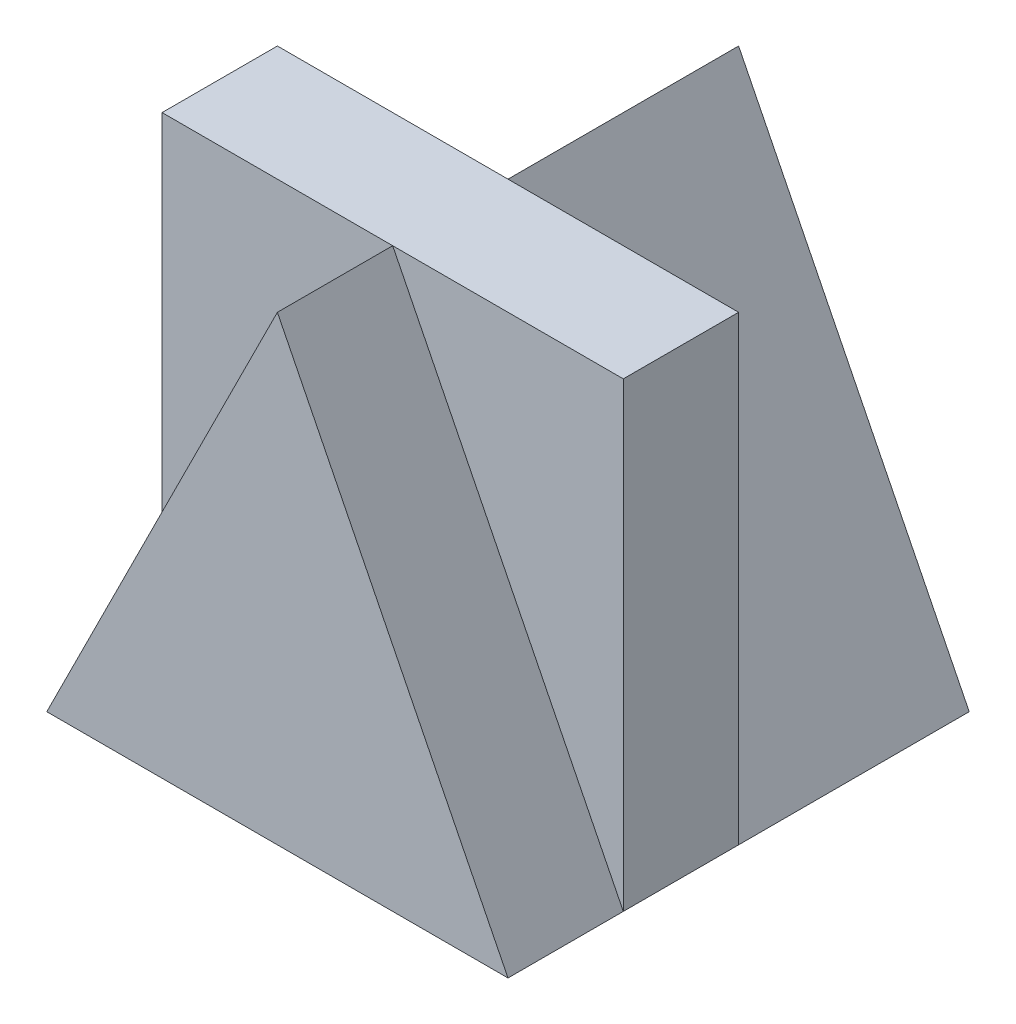
ISO-10303-21;
HEADER;
FILE_DESCRIPTION(('STEP AP214'),'2;1');
FILE_NAME('part.step','',(''),(''),'','','');
FILE_SCHEMA(('AUTOMOTIVE_DESIGN { 1 0 10303 214 1 1 1 1 }'));
ENDSEC;
DATA;
#1=APPLICATION_CONTEXT('core data for automotive mechanical design processes');
#2=APPLICATION_PROTOCOL_DEFINITION('international standard','automotive_design',2000,#1);
#3=PRODUCT_CONTEXT('',#1,'mechanical');
#4=PRODUCT('Part','Part','',(#3));
#5=PRODUCT_RELATED_PRODUCT_CATEGORY('part','',(#4));
#6=PRODUCT_DEFINITION_FORMATION('','',#4);
#7=PRODUCT_DEFINITION_CONTEXT('part definition',#1,'design');
#8=PRODUCT_DEFINITION('design','',#6,#7);
#9=PRODUCT_DEFINITION_SHAPE('','',#8);
#10=(LENGTH_UNIT() NAMED_UNIT(*) SI_UNIT(.MILLI.,.METRE.));
#11=(NAMED_UNIT(*) PLANE_ANGLE_UNIT() SI_UNIT($,.RADIAN.));
#12=(NAMED_UNIT(*) SI_UNIT($,.STERADIAN.) SOLID_ANGLE_UNIT());
#13=UNCERTAINTY_MEASURE_WITH_UNIT(LENGTH_MEASURE(1.E-05),#10,'distance_accuracy_value','');
#14=(GEOMETRIC_REPRESENTATION_CONTEXT(3) GLOBAL_UNCERTAINTY_ASSIGNED_CONTEXT((#13)) GLOBAL_UNIT_ASSIGNED_CONTEXT((#10,
#11,#12)) REPRESENTATION_CONTEXT('',''));
#15=CARTESIAN_POINT('',(0.,0.,0.));
#16=DIRECTION('',(0.,0.,1.));
#17=DIRECTION('',(1.,0.,0.));
#18=AXIS2_PLACEMENT_3D('',#15,#16,#17);
#19=CARTESIAN_POINT('',(0.,4.,0.));
#20=DIRECTION('',(0.,-1.,0.));
#21=DIRECTION('',(0.,0.,-1.));
#22=AXIS2_PLACEMENT_3D('',#19,#20,#21);
#23=PLANE('',#22);
#24=DIRECTION('',(1.,0.,0.));
#25=VECTOR('',#24,1.);
#26=CARTESIAN_POINT('',(0.,4.,0.));
#27=LINE('',#26,#25);
#28=CARTESIAN_POINT('',(-2.,4.,0.));
#29=VERTEX_POINT('',#28);
#30=CARTESIAN_POINT('',(0.,4.,0.));
#31=VERTEX_POINT('',#30);
#32=EDGE_CURVE('E152',#29,#31,#27,.T.);
#33=ORIENTED_EDGE('',*,*,#32,.F.);
#34=DIRECTION('',(0.,0.,1.));
#35=VECTOR('',#34,1.);
#36=CARTESIAN_POINT('',(-2.,4.,2.));
#37=LINE('',#36,#35);
#38=CARTESIAN_POINT('',(-2.,4.,1.));
#39=VERTEX_POINT('',#38);
#40=EDGE_CURVE('E12',#29,#39,#37,.T.);
#41=ORIENTED_EDGE('',*,*,#40,.T.);
#42=DIRECTION('',(-1.,0.,0.));
#43=VECTOR('',#42,1.);
#44=CARTESIAN_POINT('',(0.,4.,1.));
#45=LINE('',#44,#43);
#46=CARTESIAN_POINT('',(0.,4.,1.));
#47=VERTEX_POINT('',#46);
#48=EDGE_CURVE('E172',#47,#39,#45,.T.);
#49=ORIENTED_EDGE('',*,*,#48,.F.);
#50=DIRECTION('',(-1.,0.,0.));
#51=VECTOR('',#50,1.);
#52=CARTESIAN_POINT('',(0.,4.,1.));
#53=LINE('',#52,#51);
#54=CARTESIAN_POINT('',(2.,4.,1.));
#55=VERTEX_POINT('',#54);
#56=EDGE_CURVE('E187',#55,#47,#53,.T.);
#57=ORIENTED_EDGE('',*,*,#56,.F.);
#58=DIRECTION('',(0.,0.,-1.));
#59=VECTOR('',#58,1.);
#60=CARTESIAN_POINT('',(2.,4.,2.));
#61=LINE('',#60,#59);
#62=CARTESIAN_POINT('',(2.,4.,0.));
#63=VERTEX_POINT('',#62);
#64=EDGE_CURVE('E78',#55,#63,#61,.T.);
#65=ORIENTED_EDGE('',*,*,#64,.T.);
#66=DIRECTION('',(1.,0.,0.));
#67=VECTOR('',#66,1.);
#68=CARTESIAN_POINT('',(0.,4.,0.));
#69=LINE('',#68,#67);
#70=EDGE_CURVE('E202',#31,#63,#69,.T.);
#71=ORIENTED_EDGE('',*,*,#70,.F.);
#72=EDGE_LOOP('',(#33,#41,#49,#57,#65,#71));
#73=FACE_BOUND('',#72,.T.);
#74=ADVANCED_FACE('F69',(#73),#23,.F.);
#75=CARTESIAN_POINT('',(-2.,4.,-2.));
#76=DIRECTION('',(0.,0.,1.));
#77=DIRECTION('',(1.,0.,0.));
#78=AXIS2_PLACEMENT_3D('',#75,#76,#77);
#79=PLANE('',#78);
#80=DIRECTION('',(0.447213595499958,0.894427190999916,0.));
#81=VECTOR('',#80,1.);
#82=CARTESIAN_POINT('',(-1.6,0.8,-2.));
#83=LINE('',#82,#81);
#84=CARTESIAN_POINT('',(-2.,0.,-2.));
#85=VERTEX_POINT('',#84);
#86=CARTESIAN_POINT('',(0.,4.,-2.));
#87=VERTEX_POINT('',#86);
#88=EDGE_CURVE('E144',#85,#87,#83,.T.);
#89=ORIENTED_EDGE('',*,*,#88,.T.);
#90=DIRECTION('',(0.447213595499958,-0.894427190999916,0.));
#91=VECTOR('',#90,1.);
#92=CARTESIAN_POINT('',(1.6,0.8,-2.));
#93=LINE('',#92,#91);
#94=CARTESIAN_POINT('',(2.,0.,-2.));
#95=VERTEX_POINT('',#94);
#96=EDGE_CURVE('E197',#87,#95,#93,.T.);
#97=ORIENTED_EDGE('',*,*,#96,.T.);
#98=DIRECTION('',(-1.,0.,0.));
#99=VECTOR('',#98,1.);
#100=CARTESIAN_POINT('',(-2.,0.,-2.));
#101=LINE('',#100,#99);
#102=EDGE_CURVE('E162',#95,#85,#101,.T.);
#103=ORIENTED_EDGE('',*,*,#102,.T.);
#104=EDGE_LOOP('',(#89,#97,#103));
#105=FACE_BOUND('',#104,.T.);
#106=ADVANCED_FACE('F208',(#105),#79,.F.);
#107=CARTESIAN_POINT('',(-2.,4.,2.));
#108=DIRECTION('',(1.,0.,0.));
#109=DIRECTION('',(0.,0.,-1.));
#110=AXIS2_PLACEMENT_3D('',#107,#108,#109);
#111=PLANE('',#110);
#112=DIRECTION('',(0.,1.,0.));
#113=VECTOR('',#112,1.);
#114=CARTESIAN_POINT('',(-2.,0.,0.));
#115=LINE('',#114,#113);
#116=CARTESIAN_POINT('',(-2.,0.,0.));
#117=VERTEX_POINT('',#116);
#118=EDGE_CURVE('E150',#117,#29,#115,.T.);
#119=ORIENTED_EDGE('',*,*,#118,.F.);
#120=DIRECTION('',(0.,0.,1.));
#121=VECTOR('',#120,1.);
#122=CARTESIAN_POINT('',(-2.,0.,2.));
#123=LINE('',#122,#121);
#124=CARTESIAN_POINT('',(-2.,0.,1.));
#125=VERTEX_POINT('',#124);
#126=EDGE_CURVE('E94',#117,#125,#123,.T.);
#127=ORIENTED_EDGE('',*,*,#126,.T.);
#128=DIRECTION('',(0.,-1.,0.));
#129=VECTOR('',#128,1.);
#130=CARTESIAN_POINT('',(-2.,0.,1.));
#131=LINE('',#130,#129);
#132=EDGE_CURVE('E177',#39,#125,#131,.T.);
#133=ORIENTED_EDGE('',*,*,#132,.F.);
#134=ORIENTED_EDGE('',*,*,#40,.F.);
#135=EDGE_LOOP('',(#119,#127,#133,#134));
#136=FACE_BOUND('',#135,.T.);
#137=ADVANCED_FACE('F155',(#136),#111,.F.);
#138=CARTESIAN_POINT('',(2.,4.,2.));
#139=DIRECTION('',(-1.,0.,0.));
#140=DIRECTION('',(0.,0.,1.));
#141=AXIS2_PLACEMENT_3D('',#138,#139,#140);
#142=PLANE('',#141);
#143=DIRECTION('',(0.,-1.,0.));
#144=VECTOR('',#143,1.);
#145=CARTESIAN_POINT('',(2.,0.,0.));
#146=LINE('',#145,#144);
#147=CARTESIAN_POINT('',(2.,0.,0.));
#148=VERTEX_POINT('',#147);
#149=EDGE_CURVE('E86',#63,#148,#146,.T.);
#150=ORIENTED_EDGE('',*,*,#149,.F.);
#151=ORIENTED_EDGE('',*,*,#64,.F.);
#152=DIRECTION('',(0.,1.,0.));
#153=VECTOR('',#152,1.);
#154=CARTESIAN_POINT('',(2.,0.,1.));
#155=LINE('',#154,#153);
#156=CARTESIAN_POINT('',(2.,0.,1.));
#157=VERTEX_POINT('',#156);
#158=EDGE_CURVE('E178',#157,#55,#155,.T.);
#159=ORIENTED_EDGE('',*,*,#158,.F.);
#160=DIRECTION('',(0.,0.,-1.));
#161=VECTOR('',#160,1.);
#162=CARTESIAN_POINT('',(2.,0.,2.));
#163=LINE('',#162,#161);
#164=EDGE_CURVE('E166',#157,#148,#163,.T.);
#165=ORIENTED_EDGE('',*,*,#164,.T.);
#166=EDGE_LOOP('',(#150,#151,#159,#165));
#167=FACE_BOUND('',#166,.T.);
#168=ADVANCED_FACE('F71',(#167),#142,.F.);
#169=CARTESIAN_POINT('',(-2.,4.,2.));
#170=DIRECTION('',(0.,0.,-1.));
#171=DIRECTION('',(-1.,0.,0.));
#172=AXIS2_PLACEMENT_3D('',#169,#170,#171);
#173=PLANE('',#172);
#174=DIRECTION('',(1.,0.,0.));
#175=VECTOR('',#174,1.);
#176=CARTESIAN_POINT('',(-2.,0.,2.));
#177=LINE('',#176,#175);
#178=CARTESIAN_POINT('',(-2.,0.,2.));
#179=VERTEX_POINT('',#178);
#180=CARTESIAN_POINT('',(2.,0.,2.));
#181=VERTEX_POINT('',#180);
#182=EDGE_CURVE('E73',#179,#181,#177,.T.);
#183=ORIENTED_EDGE('',*,*,#182,.T.);
#184=DIRECTION('',(0.447213595499958,-0.894427190999916,0.));
#185=VECTOR('',#184,1.);
#186=CARTESIAN_POINT('',(1.6,0.8,2.));
#187=LINE('',#186,#185);
#188=CARTESIAN_POINT('',(0.,4.,2.));
#189=VERTEX_POINT('',#188);
#190=EDGE_CURVE('E185',#189,#181,#187,.T.);
#191=ORIENTED_EDGE('',*,*,#190,.F.);
#192=DIRECTION('',(0.447213595499958,0.894427190999916,0.));
#193=VECTOR('',#192,1.);
#194=CARTESIAN_POINT('',(-1.6,0.8,2.));
#195=LINE('',#194,#193);
#196=EDGE_CURVE('E174',#179,#189,#195,.T.);
#197=ORIENTED_EDGE('',*,*,#196,.F.);
#198=EDGE_LOOP('',(#183,#191,#197));
#199=FACE_BOUND('',#198,.T.);
#200=ADVANCED_FACE('F236',(#199),#173,.F.);
#201=CARTESIAN_POINT('',(0.,0.,0.));
#202=DIRECTION('',(0.,-1.,0.));
#203=DIRECTION('',(0.,0.,-1.));
#204=AXIS2_PLACEMENT_3D('',#201,#202,#203);
#205=PLANE('',#204);
#206=EDGE_CURVE('E163',#181,#157,#163,.T.);
#207=ORIENTED_EDGE('',*,*,#206,.F.);
#208=ORIENTED_EDGE('',*,*,#182,.F.);
#209=DIRECTION('',(0.,0.,1.));
#210=VECTOR('',#209,1.);
#211=CARTESIAN_POINT('',(-2.,0.,1.));
#212=LINE('',#211,#210);
#213=EDGE_CURVE('E161',#125,#179,#212,.T.);
#214=ORIENTED_EDGE('',*,*,#213,.F.);
#215=ORIENTED_EDGE('',*,*,#126,.F.);
#216=EDGE_CURVE('E138',#85,#117,#123,.T.);
#217=ORIENTED_EDGE('',*,*,#216,.F.);
#218=ORIENTED_EDGE('',*,*,#102,.F.);
#219=DIRECTION('',(0.,0.,-1.));
#220=VECTOR('',#219,1.);
#221=CARTESIAN_POINT('',(2.,0.,0.));
#222=LINE('',#221,#220);
#223=EDGE_CURVE('E188',#148,#95,#222,.T.);
#224=ORIENTED_EDGE('',*,*,#223,.F.);
#225=ORIENTED_EDGE('',*,*,#164,.F.);
#226=EDGE_LOOP('',(#207,#208,#214,#215,#217,#218,#224,#225));
#227=FACE_BOUND('',#226,.T.);
#228=ADVANCED_FACE('F159',(#227),#205,.T.);
#229=CARTESIAN_POINT('',(-1.6,0.8,1.));
#230=DIRECTION('',(0.894427190999916,-0.447213595499958,0.));
#231=DIRECTION('',(0.447213595499958,0.894427190999916,0.));
#232=AXIS2_PLACEMENT_3D('',#229,#230,#231);
#233=PLANE('',#232);
#234=ORIENTED_EDGE('',*,*,#196,.T.);
#235=DIRECTION('',(0.,0.,1.));
#236=VECTOR('',#235,1.);
#237=CARTESIAN_POINT('',(0.,4.,1.));
#238=LINE('',#237,#236);
#239=EDGE_CURVE('E171',#47,#189,#238,.T.);
#240=ORIENTED_EDGE('',*,*,#239,.F.);
#241=DIRECTION('',(0.447213595499958,0.894427190999916,0.));
#242=VECTOR('',#241,1.);
#243=CARTESIAN_POINT('',(-1.6,0.8,1.));
#244=LINE('',#243,#242);
#245=EDGE_CURVE('E181',#125,#47,#244,.T.);
#246=ORIENTED_EDGE('',*,*,#245,.F.);
#247=ORIENTED_EDGE('',*,*,#213,.T.);
#248=EDGE_LOOP('',(#234,#240,#246,#247));
#249=FACE_BOUND('',#248,.T.);
#250=ADVANCED_FACE('F229',(#249),#233,.F.);
#251=CARTESIAN_POINT('',(0.,0.,1.));
#252=DIRECTION('',(0.,0.,1.));
#253=DIRECTION('',(1.,0.,0.));
#254=AXIS2_PLACEMENT_3D('',#251,#252,#253);
#255=PLANE('',#254);
#256=ORIENTED_EDGE('',*,*,#132,.T.);
#257=ORIENTED_EDGE('',*,*,#245,.T.);
#258=ORIENTED_EDGE('',*,*,#48,.T.);
#259=EDGE_LOOP('',(#256,#257,#258));
#260=FACE_BOUND('',#259,.T.);
#261=ADVANCED_FACE('F225',(#260),#255,.T.);
#262=CARTESIAN_POINT('',(1.6,0.8,1.));
#263=DIRECTION('',(-0.894427190999916,-0.447213595499958,0.));
#264=DIRECTION('',(0.447213595499958,-0.894427190999916,0.));
#265=AXIS2_PLACEMENT_3D('',#262,#263,#264);
#266=PLANE('',#265);
#267=ORIENTED_EDGE('',*,*,#190,.T.);
#268=ORIENTED_EDGE('',*,*,#206,.T.);
#269=DIRECTION('',(0.447213595499958,-0.894427190999916,0.));
#270=VECTOR('',#269,1.);
#271=CARTESIAN_POINT('',(1.6,0.8,1.));
#272=LINE('',#271,#270);
#273=EDGE_CURVE('E190',#47,#157,#272,.T.);
#274=ORIENTED_EDGE('',*,*,#273,.F.);
#275=ORIENTED_EDGE('',*,*,#239,.T.);
#276=EDGE_LOOP('',(#267,#268,#274,#275));
#277=FACE_BOUND('',#276,.T.);
#278=ADVANCED_FACE('F233',(#277),#266,.F.);
#279=CARTESIAN_POINT('',(0.,0.,1.));
#280=DIRECTION('',(0.,0.,1.));
#281=DIRECTION('',(1.,0.,0.));
#282=AXIS2_PLACEMENT_3D('',#279,#280,#281);
#283=PLANE('',#282);
#284=ORIENTED_EDGE('',*,*,#56,.T.);
#285=ORIENTED_EDGE('',*,*,#273,.T.);
#286=ORIENTED_EDGE('',*,*,#158,.T.);
#287=EDGE_LOOP('',(#284,#285,#286));
#288=FACE_BOUND('',#287,.T.);
#289=ADVANCED_FACE('F219',(#288),#283,.T.);
#290=CARTESIAN_POINT('',(1.6,0.8,0.));
#291=DIRECTION('',(0.894427190999916,0.447213595499958,0.));
#292=DIRECTION('',(-0.447213595499958,0.894427190999916,0.));
#293=AXIS2_PLACEMENT_3D('',#290,#291,#292);
#294=PLANE('',#293);
#295=ORIENTED_EDGE('',*,*,#96,.F.);
#296=DIRECTION('',(0.,0.,-1.));
#297=VECTOR('',#296,1.);
#298=CARTESIAN_POINT('',(0.,4.,0.));
#299=LINE('',#298,#297);
#300=EDGE_CURVE('E194',#31,#87,#299,.T.);
#301=ORIENTED_EDGE('',*,*,#300,.F.);
#302=DIRECTION('',(0.447213595499958,-0.894427190999916,0.));
#303=VECTOR('',#302,1.);
#304=CARTESIAN_POINT('',(1.6,0.8,0.));
#305=LINE('',#304,#303);
#306=EDGE_CURVE('E200',#31,#148,#305,.T.);
#307=ORIENTED_EDGE('',*,*,#306,.T.);
#308=ORIENTED_EDGE('',*,*,#223,.T.);
#309=EDGE_LOOP('',(#295,#301,#307,#308));
#310=FACE_BOUND('',#309,.T.);
#311=ADVANCED_FACE('F210',(#310),#294,.T.);
#312=CARTESIAN_POINT('',(0.,0.,0.));
#313=DIRECTION('',(0.,0.,-1.));
#314=DIRECTION('',(-1.,0.,0.));
#315=AXIS2_PLACEMENT_3D('',#312,#313,#314);
#316=PLANE('',#315);
#317=ORIENTED_EDGE('',*,*,#306,.F.);
#318=ORIENTED_EDGE('',*,*,#70,.T.);
#319=ORIENTED_EDGE('',*,*,#149,.T.);
#320=EDGE_LOOP('',(#317,#318,#319));
#321=FACE_BOUND('',#320,.T.);
#322=ADVANCED_FACE('F261',(#321),#316,.T.);
#323=CARTESIAN_POINT('',(-1.6,0.8,0.));
#324=DIRECTION('',(-0.894427190999916,0.447213595499958,0.));
#325=DIRECTION('',(-0.447213595499958,-0.894427190999916,0.));
#326=AXIS2_PLACEMENT_3D('',#323,#324,#325);
#327=PLANE('',#326);
#328=ORIENTED_EDGE('',*,*,#88,.F.);
#329=ORIENTED_EDGE('',*,*,#216,.T.);
#330=DIRECTION('',(0.447213595499958,0.894427190999916,0.));
#331=VECTOR('',#330,1.);
#332=CARTESIAN_POINT('',(-1.6,0.8,0.));
#333=LINE('',#332,#331);
#334=EDGE_CURVE('E141',#117,#31,#333,.T.);
#335=ORIENTED_EDGE('',*,*,#334,.T.);
#336=ORIENTED_EDGE('',*,*,#300,.T.);
#337=EDGE_LOOP('',(#328,#329,#335,#336));
#338=FACE_BOUND('',#337,.T.);
#339=ADVANCED_FACE('F140',(#338),#327,.T.);
#340=CARTESIAN_POINT('',(0.,0.,0.));
#341=DIRECTION('',(0.,0.,-1.));
#342=DIRECTION('',(-1.,0.,0.));
#343=AXIS2_PLACEMENT_3D('',#340,#341,#342);
#344=PLANE('',#343);
#345=ORIENTED_EDGE('',*,*,#334,.F.);
#346=ORIENTED_EDGE('',*,*,#118,.T.);
#347=ORIENTED_EDGE('',*,*,#32,.T.);
#348=EDGE_LOOP('',(#345,#346,#347));
#349=FACE_BOUND('',#348,.T.);
#350=ADVANCED_FACE('F149',(#349),#344,.T.);
#351=CLOSED_SHELL('',(#74,#106,#137,#168,#200,#228,#250,#261,#278,#289,#311,#322,#339,#350));
#352=MANIFOLD_SOLID_BREP('B2',#351);
#353=ADVANCED_BREP_SHAPE_REPRESENTATION('',(#18,#352),#14);
#354=SHAPE_DEFINITION_REPRESENTATION(#9,#353);
ENDSEC;
END-ISO-10303-21;
